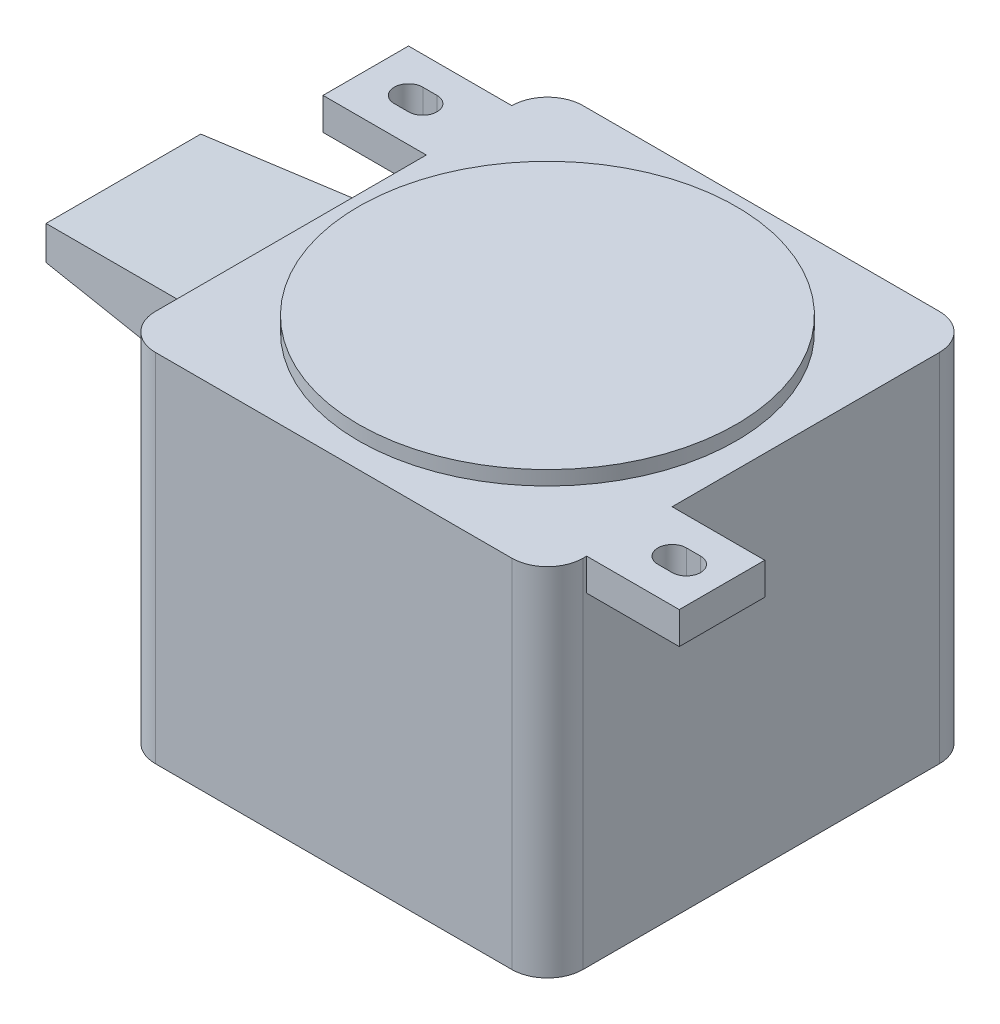
ISO-10303-21;
HEADER;
FILE_DESCRIPTION(('STEP AP214'),'2;1');
FILE_NAME('part.step','',(''),(''),'','','');
FILE_SCHEMA(('AUTOMOTIVE_DESIGN { 1 0 10303 214 1 1 1 1 }'));
ENDSEC;
DATA;
#1=APPLICATION_CONTEXT('core data for automotive mechanical design processes');
#2=APPLICATION_PROTOCOL_DEFINITION('international standard','automotive_design',2000,#1);
#3=PRODUCT_CONTEXT('',#1,'mechanical');
#4=PRODUCT('Part','Part','',(#3));
#5=PRODUCT_RELATED_PRODUCT_CATEGORY('part','',(#4));
#6=PRODUCT_DEFINITION_FORMATION('','',#4);
#7=PRODUCT_DEFINITION_CONTEXT('part definition',#1,'design');
#8=PRODUCT_DEFINITION('design','',#6,#7);
#9=PRODUCT_DEFINITION_SHAPE('','',#8);
#10=(LENGTH_UNIT() NAMED_UNIT(*) SI_UNIT(.MILLI.,.METRE.));
#11=(NAMED_UNIT(*) PLANE_ANGLE_UNIT() SI_UNIT($,.RADIAN.));
#12=(NAMED_UNIT(*) SI_UNIT($,.STERADIAN.) SOLID_ANGLE_UNIT());
#13=UNCERTAINTY_MEASURE_WITH_UNIT(LENGTH_MEASURE(1.E-05),#10,'distance_accuracy_value','');
#14=(GEOMETRIC_REPRESENTATION_CONTEXT(3) GLOBAL_UNCERTAINTY_ASSIGNED_CONTEXT((#13)) GLOBAL_UNIT_ASSIGNED_CONTEXT((#10,
#11,#12)) REPRESENTATION_CONTEXT('',''));
#15=CARTESIAN_POINT('',(0.,0.,0.));
#16=DIRECTION('',(0.,0.,1.));
#17=DIRECTION('',(1.,0.,0.));
#18=AXIS2_PLACEMENT_3D('',#15,#16,#17);
#19=CARTESIAN_POINT('',(-30.,-50.,-30.));
#20=DIRECTION('',(-1.,0.,0.));
#21=DIRECTION('',(0.,0.,1.));
#22=AXIS2_PLACEMENT_3D('',#19,#20,#21);
#23=PLANE('',#22);
#24=DIRECTION('',(0.,0.,1.));
#25=VECTOR('',#24,1.);
#26=CARTESIAN_POINT('',(-30.,-50.,-30.));
#27=LINE('',#26,#25);
#28=CARTESIAN_POINT('',(-30.,-50.,-25.));
#29=VERTEX_POINT('',#28);
#30=CARTESIAN_POINT('',(-30.,-50.,25.));
#31=VERTEX_POINT('',#30);
#32=EDGE_CURVE('E437',#29,#31,#27,.T.);
#33=ORIENTED_EDGE('',*,*,#32,.T.);
#34=DIRECTION('',(0.,1.,0.));
#35=VECTOR('',#34,1.);
#36=CARTESIAN_POINT('',(-30.,-50.,25.));
#37=LINE('',#36,#35);
#38=CARTESIAN_POINT('',(-30.,0.,25.));
#39=VERTEX_POINT('',#38);
#40=EDGE_CURVE('E480',#31,#39,#37,.T.);
#41=ORIENTED_EDGE('',*,*,#40,.T.);
#42=DIRECTION('',(0.,0.,1.));
#43=VECTOR('',#42,1.);
#44=CARTESIAN_POINT('',(-30.,0.,-30.));
#45=LINE('',#44,#43);
#46=CARTESIAN_POINT('',(-30.,0.,-13.));
#47=VERTEX_POINT('',#46);
#48=EDGE_CURVE('E449',#47,#39,#45,.T.);
#49=ORIENTED_EDGE('',*,*,#48,.F.);
#50=DIRECTION('',(0.,1.,0.));
#51=VECTOR('',#50,1.);
#52=CARTESIAN_POINT('',(-30.,-4.5,-13.));
#53=LINE('',#52,#51);
#54=CARTESIAN_POINT('',(-30.,-4.5,-13.));
#55=VERTEX_POINT('',#54);
#56=EDGE_CURVE('E422',#55,#47,#53,.T.);
#57=ORIENTED_EDGE('',*,*,#56,.F.);
#58=DIRECTION('',(0.,0.,-1.));
#59=VECTOR('',#58,1.);
#60=CARTESIAN_POINT('',(-30.,-4.5,-13.));
#61=LINE('',#60,#59);
#62=CARTESIAN_POINT('',(-30.,-4.5,-25.));
#63=VERTEX_POINT('',#62);
#64=EDGE_CURVE('E401',#55,#63,#61,.T.);
#65=ORIENTED_EDGE('',*,*,#64,.T.);
#66=DIRECTION('',(0.,1.,0.));
#67=VECTOR('',#66,1.);
#68=CARTESIAN_POINT('',(-30.,-50.,-25.));
#69=LINE('',#68,#67);
#70=EDGE_CURVE('E478',#63,#29,#69,.F.);
#71=ORIENTED_EDGE('',*,*,#70,.T.);
#72=EDGE_LOOP('',(#33,#41,#49,#57,#65,#71));
#73=FACE_BOUND('',#72,.T.);
#74=DIRECTION('',(0.,0.,1.));
#75=VECTOR('',#74,1.);
#76=CARTESIAN_POINT('',(-30.,-29.85,-18.5));
#77=LINE('',#76,#75);
#78=CARTESIAN_POINT('',(-30.,-29.85,-21.5));
#79=VERTEX_POINT('',#78);
#80=CARTESIAN_POINT('',(-30.,-29.85,-18.5));
#81=VERTEX_POINT('',#80);
#82=EDGE_CURVE('E263',#79,#81,#77,.T.);
#83=ORIENTED_EDGE('',*,*,#82,.F.);
#84=DIRECTION('',(0.,-1.,0.));
#85=VECTOR('',#84,1.);
#86=CARTESIAN_POINT('',(-30.,-29.85,-21.5));
#87=LINE('',#86,#85);
#88=CARTESIAN_POINT('',(-30.,-26.85,-21.5));
#89=VERTEX_POINT('',#88);
#90=EDGE_CURVE('E243',#89,#79,#87,.T.);
#91=ORIENTED_EDGE('',*,*,#90,.F.);
#92=DIRECTION('',(0.,-0.90286051882393,-0.429933580392348));
#93=VECTOR('',#92,1.);
#94=CARTESIAN_POINT('',(-30.,-26.85,-21.5));
#95=LINE('',#94,#93);
#96=CARTESIAN_POINT('',(-30.,-9.,-13.));
#97=VERTEX_POINT('',#96);
#98=EDGE_CURVE('E254',#97,#89,#95,.T.);
#99=ORIENTED_EDGE('',*,*,#98,.F.);
#100=DIRECTION('',(0.,0.,-1.));
#101=VECTOR('',#100,1.);
#102=CARTESIAN_POINT('',(-30.,-9.,-13.));
#103=LINE('',#102,#101);
#104=CARTESIAN_POINT('',(-30.,-9.,13.));
#105=VERTEX_POINT('',#104);
#106=EDGE_CURVE('E274',#105,#97,#103,.T.);
#107=ORIENTED_EDGE('',*,*,#106,.F.);
#108=DIRECTION('',(0.,1.,0.));
#109=VECTOR('',#108,1.);
#110=CARTESIAN_POINT('',(-30.,-9.,13.));
#111=LINE('',#110,#109);
#112=CARTESIAN_POINT('',(-30.,-19.,13.));
#113=VERTEX_POINT('',#112);
#114=EDGE_CURVE('E272',#113,#105,#111,.T.);
#115=ORIENTED_EDGE('',*,*,#114,.F.);
#116=DIRECTION('',(0.,0.,1.));
#117=VECTOR('',#116,1.);
#118=CARTESIAN_POINT('',(-30.,-19.,13.));
#119=LINE('',#118,#117);
#120=CARTESIAN_POINT('',(-30.,-19.,-13.));
#121=VERTEX_POINT('',#120);
#122=EDGE_CURVE('E270',#121,#113,#119,.T.);
#123=ORIENTED_EDGE('',*,*,#122,.F.);
#124=DIRECTION('',(0.,0.891947376713938,0.452139223219047));
#125=VECTOR('',#124,1.);
#126=CARTESIAN_POINT('',(-30.,-19.,-13.));
#127=LINE('',#126,#125);
#128=EDGE_CURVE('E265',#81,#121,#127,.T.);
#129=ORIENTED_EDGE('',*,*,#128,.F.);
#130=EDGE_LOOP('',(#83,#91,#99,#107,#115,#123,#129));
#131=FACE_BOUND('',#130,.T.);
#132=ADVANCED_FACE('F35',(#73,#131),#23,.T.);
#133=CARTESIAN_POINT('',(30.,-50.,-30.));
#134=DIRECTION('',(1.,0.,0.));
#135=DIRECTION('',(0.,0.,-1.));
#136=AXIS2_PLACEMENT_3D('',#133,#134,#135);
#137=PLANE('',#136);
#138=DIRECTION('',(0.,0.,-1.));
#139=VECTOR('',#138,1.);
#140=CARTESIAN_POINT('',(30.,0.,-30.));
#141=LINE('',#140,#139);
#142=CARTESIAN_POINT('',(30.,0.,25.));
#143=VERTEX_POINT('',#142);
#144=CARTESIAN_POINT('',(30.,0.,24.5));
#145=VERTEX_POINT('',#144);
#146=EDGE_CURVE('E444',#143,#145,#141,.T.);
#147=ORIENTED_EDGE('',*,*,#146,.F.);
#148=DIRECTION('',(0.,1.,0.));
#149=VECTOR('',#148,1.);
#150=CARTESIAN_POINT('',(30.,-50.,25.));
#151=LINE('',#150,#149);
#152=CARTESIAN_POINT('',(30.,-50.,25.));
#153=VERTEX_POINT('',#152);
#154=EDGE_CURVE('E469',#143,#153,#151,.F.);
#155=ORIENTED_EDGE('',*,*,#154,.T.);
#156=DIRECTION('',(0.,0.,-1.));
#157=VECTOR('',#156,1.);
#158=CARTESIAN_POINT('',(30.,-50.,-30.));
#159=LINE('',#158,#157);
#160=CARTESIAN_POINT('',(30.,-50.,-25.));
#161=VERTEX_POINT('',#160);
#162=EDGE_CURVE('E431',#153,#161,#159,.T.);
#163=ORIENTED_EDGE('',*,*,#162,.T.);
#164=DIRECTION('',(0.,1.,0.));
#165=VECTOR('',#164,1.);
#166=CARTESIAN_POINT('',(30.,-50.,-25.));
#167=LINE('',#166,#165);
#168=CARTESIAN_POINT('',(30.,0.,-25.));
#169=VERTEX_POINT('',#168);
#170=EDGE_CURVE('E466',#161,#169,#167,.T.);
#171=ORIENTED_EDGE('',*,*,#170,.T.);
#172=CARTESIAN_POINT('',(30.,0.,12.5));
#173=VERTEX_POINT('',#172);
#174=EDGE_CURVE('E424',#173,#169,#141,.T.);
#175=ORIENTED_EDGE('',*,*,#174,.F.);
#176=DIRECTION('',(0.,1.,0.));
#177=VECTOR('',#176,1.);
#178=CARTESIAN_POINT('',(30.,-4.5,12.5));
#179=LINE('',#178,#177);
#180=CARTESIAN_POINT('',(30.,-4.5,12.5));
#181=VERTEX_POINT('',#180);
#182=EDGE_CURVE('E360',#181,#173,#179,.T.);
#183=ORIENTED_EDGE('',*,*,#182,.F.);
#184=DIRECTION('',(0.,0.,1.));
#185=VECTOR('',#184,1.);
#186=CARTESIAN_POINT('',(30.,-4.5,24.5));
#187=LINE('',#186,#185);
#188=CARTESIAN_POINT('',(30.,-4.5,24.5));
#189=VERTEX_POINT('',#188);
#190=EDGE_CURVE('E339',#181,#189,#187,.T.);
#191=ORIENTED_EDGE('',*,*,#190,.T.);
#192=DIRECTION('',(0.,1.,0.));
#193=VECTOR('',#192,1.);
#194=CARTESIAN_POINT('',(30.,-4.5,24.5));
#195=LINE('',#194,#193);
#196=EDGE_CURVE('E352',#189,#145,#195,.T.);
#197=ORIENTED_EDGE('',*,*,#196,.T.);
#198=EDGE_LOOP('',(#147,#155,#163,#171,#175,#183,#191,#197));
#199=FACE_BOUND('',#198,.T.);
#200=ADVANCED_FACE('F496',(#199),#137,.T.);
#201=CARTESIAN_POINT('',(-30.,-50.,30.));
#202=DIRECTION('',(0.,0.,1.));
#203=DIRECTION('',(1.,0.,0.));
#204=AXIS2_PLACEMENT_3D('',#201,#202,#203);
#205=PLANE('',#204);
#206=DIRECTION('',(1.,0.,0.));
#207=VECTOR('',#206,1.);
#208=CARTESIAN_POINT('',(-30.,-50.,30.));
#209=LINE('',#208,#207);
#210=CARTESIAN_POINT('',(-25.,-50.,30.));
#211=VERTEX_POINT('',#210);
#212=CARTESIAN_POINT('',(25.,-50.,30.));
#213=VERTEX_POINT('',#212);
#214=EDGE_CURVE('E440',#211,#213,#209,.T.);
#215=ORIENTED_EDGE('',*,*,#214,.T.);
#216=DIRECTION('',(0.,1.,0.));
#217=VECTOR('',#216,1.);
#218=CARTESIAN_POINT('',(25.,-50.,30.));
#219=LINE('',#218,#217);
#220=CARTESIAN_POINT('',(25.,0.,30.));
#221=VERTEX_POINT('',#220);
#222=EDGE_CURVE('E455',#213,#221,#219,.T.);
#223=ORIENTED_EDGE('',*,*,#222,.T.);
#224=DIRECTION('',(1.,0.,0.));
#225=VECTOR('',#224,1.);
#226=CARTESIAN_POINT('',(-30.,0.,30.));
#227=LINE('',#226,#225);
#228=CARTESIAN_POINT('',(-25.,0.,30.));
#229=VERTEX_POINT('',#228);
#230=EDGE_CURVE('E435',#229,#221,#227,.T.);
#231=ORIENTED_EDGE('',*,*,#230,.F.);
#232=DIRECTION('',(0.,1.,0.));
#233=VECTOR('',#232,1.);
#234=CARTESIAN_POINT('',(-25.,-50.,30.));
#235=LINE('',#234,#233);
#236=EDGE_CURVE('E443',#229,#211,#235,.F.);
#237=ORIENTED_EDGE('',*,*,#236,.T.);
#238=EDGE_LOOP('',(#215,#223,#231,#237));
#239=FACE_BOUND('',#238,.T.);
#240=ADVANCED_FACE('F521',(#239),#205,.T.);
#241=CARTESIAN_POINT('',(-30.,-50.,-30.));
#242=DIRECTION('',(0.,0.,-1.));
#243=DIRECTION('',(-1.,0.,0.));
#244=AXIS2_PLACEMENT_3D('',#241,#242,#243);
#245=PLANE('',#244);
#246=DIRECTION('',(-1.,0.,0.));
#247=VECTOR('',#246,1.);
#248=CARTESIAN_POINT('',(-30.,-50.,-30.));
#249=LINE('',#248,#247);
#250=CARTESIAN_POINT('',(25.,-50.,-30.));
#251=VERTEX_POINT('',#250);
#252=CARTESIAN_POINT('',(-25.,-50.,-30.));
#253=VERTEX_POINT('',#252);
#254=EDGE_CURVE('E434',#251,#253,#249,.T.);
#255=ORIENTED_EDGE('',*,*,#254,.T.);
#256=DIRECTION('',(0.,1.,0.));
#257=VECTOR('',#256,1.);
#258=CARTESIAN_POINT('',(-25.,-50.,-30.));
#259=LINE('',#258,#257);
#260=CARTESIAN_POINT('',(-25.,0.,-30.));
#261=VERTEX_POINT('',#260);
#262=EDGE_CURVE('E11',#253,#261,#259,.T.);
#263=ORIENTED_EDGE('',*,*,#262,.T.);
#264=DIRECTION('',(-1.,0.,0.));
#265=VECTOR('',#264,1.);
#266=CARTESIAN_POINT('',(-30.,0.,-30.));
#267=LINE('',#266,#265);
#268=CARTESIAN_POINT('',(25.,0.,-30.));
#269=VERTEX_POINT('',#268);
#270=EDGE_CURVE('E446',#269,#261,#267,.T.);
#271=ORIENTED_EDGE('',*,*,#270,.F.);
#272=DIRECTION('',(0.,1.,0.));
#273=VECTOR('',#272,1.);
#274=CARTESIAN_POINT('',(25.,-50.,-30.));
#275=LINE('',#274,#273);
#276=EDGE_CURVE('E43',#269,#251,#275,.F.);
#277=ORIENTED_EDGE('',*,*,#276,.T.);
#278=EDGE_LOOP('',(#255,#263,#271,#277));
#279=FACE_BOUND('',#278,.T.);
#280=ADVANCED_FACE('F485',(#279),#245,.T.);
#281=CARTESIAN_POINT('',(0.,-50.,0.));
#282=DIRECTION('',(0.,1.,0.));
#283=DIRECTION('',(0.,0.,1.));
#284=AXIS2_PLACEMENT_3D('',#281,#282,#283);
#285=PLANE('',#284);
#286=ORIENTED_EDGE('',*,*,#162,.F.);
#287=CARTESIAN_POINT('',(25.,-50.,25.));
#288=DIRECTION('',(0.,1.,0.));
#289=DIRECTION('',(0.,0.,1.));
#290=AXIS2_PLACEMENT_3D('',#287,#288,#289);
#291=CIRCLE('',#290,5.);
#292=EDGE_CURVE('E476',#153,#213,#291,.F.);
#293=ORIENTED_EDGE('',*,*,#292,.T.);
#294=ORIENTED_EDGE('',*,*,#214,.F.);
#295=CARTESIAN_POINT('',(-25.,-50.,25.));
#296=DIRECTION('',(0.,1.,0.));
#297=DIRECTION('',(0.,0.,1.));
#298=AXIS2_PLACEMENT_3D('',#295,#296,#297);
#299=CIRCLE('',#298,5.);
#300=EDGE_CURVE('E474',#211,#31,#299,.F.);
#301=ORIENTED_EDGE('',*,*,#300,.T.);
#302=ORIENTED_EDGE('',*,*,#32,.F.);
#303=CARTESIAN_POINT('',(-25.,-50.,-25.));
#304=DIRECTION('',(0.,1.,0.));
#305=DIRECTION('',(0.,0.,1.));
#306=AXIS2_PLACEMENT_3D('',#303,#304,#305);
#307=CIRCLE('',#306,5.);
#308=EDGE_CURVE('E58',#29,#253,#307,.F.);
#309=ORIENTED_EDGE('',*,*,#308,.T.);
#310=ORIENTED_EDGE('',*,*,#254,.F.);
#311=CARTESIAN_POINT('',(25.,-50.,-25.));
#312=DIRECTION('',(0.,1.,0.));
#313=DIRECTION('',(0.,0.,1.));
#314=AXIS2_PLACEMENT_3D('',#311,#312,#313);
#315=CIRCLE('',#314,5.);
#316=EDGE_CURVE('E471',#251,#161,#315,.F.);
#317=ORIENTED_EDGE('',*,*,#316,.T.);
#318=EDGE_LOOP('',(#286,#293,#294,#301,#302,#309,#310,#317));
#319=FACE_BOUND('',#318,.T.);
#320=ADVANCED_FACE('F490',(#319),#285,.F.);
#321=CARTESIAN_POINT('',(0.,0.,0.));
#322=DIRECTION('',(0.,1.,0.));
#323=DIRECTION('',(0.,0.,1.));
#324=AXIS2_PLACEMENT_3D('',#321,#322,#323);
#325=PLANE('',#324);
#326=CARTESIAN_POINT('',(0.,0.,0.));
#327=DIRECTION('',(0.,1.,0.));
#328=DIRECTION('',(0.,0.,1.));
#329=AXIS2_PLACEMENT_3D('',#326,#327,#328);
#330=CIRCLE('',#329,26.5);
#331=CARTESIAN_POINT('',(0.,0.,26.5));
#332=VERTEX_POINT('',#331);
#333=EDGE_CURVE('E300',#332,#332,#330,.T.);
#334=ORIENTED_EDGE('',*,*,#333,.F.);
#335=EDGE_LOOP('',(#334));
#336=FACE_BOUND('',#335,.T.);
#337=ORIENTED_EDGE('',*,*,#230,.T.);
#338=CARTESIAN_POINT('',(25.,0.,25.));
#339=DIRECTION('',(0.,1.,0.));
#340=DIRECTION('',(0.,0.,1.));
#341=AXIS2_PLACEMENT_3D('',#338,#339,#340);
#342=CIRCLE('',#341,5.);
#343=EDGE_CURVE('E464',#221,#143,#342,.T.);
#344=ORIENTED_EDGE('',*,*,#343,.T.);
#345=ORIENTED_EDGE('',*,*,#146,.T.);
#346=DIRECTION('',(1.,0.,0.));
#347=VECTOR('',#346,1.);
#348=CARTESIAN_POINT('',(43.,0.,24.5));
#349=LINE('',#348,#347);
#350=CARTESIAN_POINT('',(43.,0.,24.5));
#351=VERTEX_POINT('',#350);
#352=EDGE_CURVE('E332',#145,#351,#349,.T.);
#353=ORIENTED_EDGE('',*,*,#352,.T.);
#354=DIRECTION('',(0.,0.,-1.));
#355=VECTOR('',#354,1.);
#356=CARTESIAN_POINT('',(43.,0.,12.5));
#357=LINE('',#356,#355);
#358=CARTESIAN_POINT('',(43.,0.,12.5));
#359=VERTEX_POINT('',#358);
#360=EDGE_CURVE('E355',#351,#359,#357,.T.);
#361=ORIENTED_EDGE('',*,*,#360,.T.);
#362=DIRECTION('',(-1.,0.,0.));
#363=VECTOR('',#362,1.);
#364=CARTESIAN_POINT('',(30.,0.,12.5));
#365=LINE('',#364,#363);
#366=EDGE_CURVE('E343',#359,#173,#365,.T.);
#367=ORIENTED_EDGE('',*,*,#366,.T.);
#368=ORIENTED_EDGE('',*,*,#174,.T.);
#369=CARTESIAN_POINT('',(25.,0.,-25.));
#370=DIRECTION('',(0.,1.,0.));
#371=DIRECTION('',(0.,0.,1.));
#372=AXIS2_PLACEMENT_3D('',#369,#370,#371);
#373=CIRCLE('',#372,5.);
#374=EDGE_CURVE('E458',#169,#269,#373,.T.);
#375=ORIENTED_EDGE('',*,*,#374,.T.);
#376=ORIENTED_EDGE('',*,*,#270,.T.);
#377=CARTESIAN_POINT('',(-25.,0.,-25.));
#378=DIRECTION('',(0.,1.,0.));
#379=DIRECTION('',(0.,0.,1.));
#380=AXIS2_PLACEMENT_3D('',#377,#378,#379);
#381=CIRCLE('',#380,5.);
#382=CARTESIAN_POINT('',(-30.,0.,-25.));
#383=VERTEX_POINT('',#382);
#384=EDGE_CURVE('E460',#261,#383,#381,.T.);
#385=ORIENTED_EDGE('',*,*,#384,.T.);
#386=DIRECTION('',(-1.,0.,0.));
#387=VECTOR('',#386,1.);
#388=CARTESIAN_POINT('',(-30.,0.,-25.));
#389=LINE('',#388,#387);
#390=CARTESIAN_POINT('',(-44.5,0.,-25.));
#391=VERTEX_POINT('',#390);
#392=EDGE_CURVE('E394',#383,#391,#389,.T.);
#393=ORIENTED_EDGE('',*,*,#392,.T.);
#394=DIRECTION('',(0.,0.,1.));
#395=VECTOR('',#394,1.);
#396=CARTESIAN_POINT('',(-44.5,0.,-25.));
#397=LINE('',#396,#395);
#398=CARTESIAN_POINT('',(-44.5,0.,-13.));
#399=VERTEX_POINT('',#398);
#400=EDGE_CURVE('E417',#391,#399,#397,.T.);
#401=ORIENTED_EDGE('',*,*,#400,.T.);
#402=DIRECTION('',(1.,0.,0.));
#403=VECTOR('',#402,1.);
#404=CARTESIAN_POINT('',(-44.5,0.,-13.));
#405=LINE('',#404,#403);
#406=EDGE_CURVE('E405',#399,#47,#405,.T.);
#407=ORIENTED_EDGE('',*,*,#406,.T.);
#408=ORIENTED_EDGE('',*,*,#48,.T.);
#409=CARTESIAN_POINT('',(-25.,0.,25.));
#410=DIRECTION('',(0.,1.,0.));
#411=DIRECTION('',(0.,0.,1.));
#412=AXIS2_PLACEMENT_3D('',#409,#410,#411);
#413=CIRCLE('',#412,5.);
#414=EDGE_CURVE('E462',#39,#229,#413,.T.);
#415=ORIENTED_EDGE('',*,*,#414,.T.);
#416=EDGE_LOOP('',(#337,#344,#345,#353,#361,#367,#368,#375,#376,#385,#393,#401,#407,#408,#415));
#417=FACE_BOUND('',#416,.T.);
#418=CARTESIAN_POINT('',(-38.5,0.,-19.));
#419=DIRECTION('',(0.,1.,0.));
#420=DIRECTION('',(0.,0.,1.));
#421=AXIS2_PLACEMENT_3D('',#418,#419,#420);
#422=CIRCLE('',#421,2.);
#423=CARTESIAN_POINT('',(-38.5,0.,-21.));
#424=VERTEX_POINT('',#423);
#425=CARTESIAN_POINT('',(-38.5,0.,-17.));
#426=VERTEX_POINT('',#425);
#427=EDGE_CURVE('E362',#424,#426,#422,.T.);
#428=ORIENTED_EDGE('',*,*,#427,.F.);
#429=DIRECTION('',(-1.,0.,0.));
#430=VECTOR('',#429,1.);
#431=CARTESIAN_POINT('',(-38.5,0.,-21.));
#432=LINE('',#431,#430);
#433=CARTESIAN_POINT('',(-36.5,0.,-21.));
#434=VERTEX_POINT('',#433);
#435=EDGE_CURVE('E373',#434,#424,#432,.T.);
#436=ORIENTED_EDGE('',*,*,#435,.F.);
#437=CARTESIAN_POINT('',(-36.5,0.,-19.));
#438=DIRECTION('',(0.,1.,0.));
#439=DIRECTION('',(0.,0.,1.));
#440=AXIS2_PLACEMENT_3D('',#437,#438,#439);
#441=CIRCLE('',#440,2.);
#442=CARTESIAN_POINT('',(-36.5,0.,-17.));
#443=VERTEX_POINT('',#442);
#444=EDGE_CURVE('E387',#443,#434,#441,.T.);
#445=ORIENTED_EDGE('',*,*,#444,.F.);
#446=DIRECTION('',(1.,0.,0.));
#447=VECTOR('',#446,1.);
#448=CARTESIAN_POINT('',(-38.5,0.,-17.));
#449=LINE('',#448,#447);
#450=EDGE_CURVE('E384',#426,#443,#449,.T.);
#451=ORIENTED_EDGE('',*,*,#450,.F.);
#452=EDGE_LOOP('',(#428,#436,#445,#451));
#453=FACE_BOUND('',#452,.T.);
#454=DIRECTION('',(1.,0.,0.));
#455=VECTOR('',#454,1.);
#456=CARTESIAN_POINT('',(36.,0.,20.5));
#457=LINE('',#456,#455);
#458=CARTESIAN_POINT('',(36.,0.,20.5));
#459=VERTEX_POINT('',#458);
#460=CARTESIAN_POINT('',(38.,0.,20.5));
#461=VERTEX_POINT('',#460);
#462=EDGE_CURVE('E322',#459,#461,#457,.T.);
#463=ORIENTED_EDGE('',*,*,#462,.F.);
#464=CARTESIAN_POINT('',(36.,0.,18.5));
#465=DIRECTION('',(0.,1.,0.));
#466=DIRECTION('',(0.,0.,1.));
#467=AXIS2_PLACEMENT_3D('',#464,#465,#466);
#468=CIRCLE('',#467,2.);
#469=CARTESIAN_POINT('',(36.,0.,16.5));
#470=VERTEX_POINT('',#469);
#471=EDGE_CURVE('E304',#470,#459,#468,.T.);
#472=ORIENTED_EDGE('',*,*,#471,.F.);
#473=DIRECTION('',(-1.,0.,0.));
#474=VECTOR('',#473,1.);
#475=CARTESIAN_POINT('',(36.,0.,16.5));
#476=LINE('',#475,#474);
#477=CARTESIAN_POINT('',(38.,0.,16.5));
#478=VERTEX_POINT('',#477);
#479=EDGE_CURVE('E311',#478,#470,#476,.T.);
#480=ORIENTED_EDGE('',*,*,#479,.F.);
#481=CARTESIAN_POINT('',(38.,0.,18.5));
#482=DIRECTION('',(0.,1.,0.));
#483=DIRECTION('',(0.,0.,1.));
#484=AXIS2_PLACEMENT_3D('',#481,#482,#483);
#485=CIRCLE('',#484,2.);
#486=EDGE_CURVE('E325',#461,#478,#485,.T.);
#487=ORIENTED_EDGE('',*,*,#486,.F.);
#488=EDGE_LOOP('',(#463,#472,#480,#487));
#489=FACE_BOUND('',#488,.T.);
#490=ADVANCED_FACE('F499',(#336,#417,#453,#489),#325,.T.);
#491=CARTESIAN_POINT('',(-44.5,-4.5,-13.));
#492=DIRECTION('',(0.,0.,1.));
#493=DIRECTION('',(1.,0.,0.));
#494=AXIS2_PLACEMENT_3D('',#491,#492,#493);
#495=PLANE('',#494);
#496=ORIENTED_EDGE('',*,*,#406,.F.);
#497=DIRECTION('',(0.,1.,0.));
#498=VECTOR('',#497,1.);
#499=CARTESIAN_POINT('',(-44.5,-4.5,-13.));
#500=LINE('',#499,#498);
#501=CARTESIAN_POINT('',(-44.5,-4.5,-13.));
#502=VERTEX_POINT('',#501);
#503=EDGE_CURVE('E425',#502,#399,#500,.T.);
#504=ORIENTED_EDGE('',*,*,#503,.F.);
#505=DIRECTION('',(1.,0.,0.));
#506=VECTOR('',#505,1.);
#507=CARTESIAN_POINT('',(-44.5,-4.5,-13.));
#508=LINE('',#507,#506);
#509=EDGE_CURVE('E411',#502,#55,#508,.T.);
#510=ORIENTED_EDGE('',*,*,#509,.T.);
#511=ORIENTED_EDGE('',*,*,#56,.T.);
#512=EDGE_LOOP('',(#496,#504,#510,#511));
#513=FACE_BOUND('',#512,.T.);
#514=ADVANCED_FACE('F543',(#513),#495,.T.);
#515=CARTESIAN_POINT('',(-44.5,-4.5,-25.));
#516=DIRECTION('',(-1.,0.,0.));
#517=DIRECTION('',(0.,0.,1.));
#518=AXIS2_PLACEMENT_3D('',#515,#516,#517);
#519=PLANE('',#518);
#520=ORIENTED_EDGE('',*,*,#400,.F.);
#521=DIRECTION('',(0.,1.,0.));
#522=VECTOR('',#521,1.);
#523=CARTESIAN_POINT('',(-44.5,-4.5,-25.));
#524=LINE('',#523,#522);
#525=CARTESIAN_POINT('',(-44.5,-4.5,-25.));
#526=VERTEX_POINT('',#525);
#527=EDGE_CURVE('E427',#526,#391,#524,.T.);
#528=ORIENTED_EDGE('',*,*,#527,.F.);
#529=DIRECTION('',(0.,0.,1.));
#530=VECTOR('',#529,1.);
#531=CARTESIAN_POINT('',(-44.5,-4.5,-25.));
#532=LINE('',#531,#530);
#533=EDGE_CURVE('E408',#526,#502,#532,.T.);
#534=ORIENTED_EDGE('',*,*,#533,.T.);
#535=ORIENTED_EDGE('',*,*,#503,.T.);
#536=EDGE_LOOP('',(#520,#528,#534,#535));
#537=FACE_BOUND('',#536,.T.);
#538=ADVANCED_FACE('F540',(#537),#519,.T.);
#539=CARTESIAN_POINT('',(-30.,-4.5,-25.));
#540=DIRECTION('',(0.,0.,-1.));
#541=DIRECTION('',(-1.,0.,0.));
#542=AXIS2_PLACEMENT_3D('',#539,#540,#541);
#543=PLANE('',#542);
#544=ORIENTED_EDGE('',*,*,#392,.F.);
#545=DIRECTION('',(0.,1.,0.));
#546=VECTOR('',#545,1.);
#547=CARTESIAN_POINT('',(-30.,-4.5,-25.));
#548=LINE('',#547,#546);
#549=EDGE_CURVE('E414',#63,#383,#548,.T.);
#550=ORIENTED_EDGE('',*,*,#549,.F.);
#551=DIRECTION('',(-1.,0.,0.));
#552=VECTOR('',#551,1.);
#553=CARTESIAN_POINT('',(-30.,-4.5,-25.));
#554=LINE('',#553,#552);
#555=EDGE_CURVE('E404',#63,#526,#554,.T.);
#556=ORIENTED_EDGE('',*,*,#555,.T.);
#557=ORIENTED_EDGE('',*,*,#527,.T.);
#558=EDGE_LOOP('',(#544,#550,#556,#557));
#559=FACE_BOUND('',#558,.T.);
#560=ADVANCED_FACE('F535',(#559),#543,.T.);
#561=CARTESIAN_POINT('',(0.,-4.5,0.));
#562=DIRECTION('',(0.,1.,0.));
#563=DIRECTION('',(0.,0.,1.));
#564=AXIS2_PLACEMENT_3D('',#561,#562,#563);
#565=PLANE('',#564);
#566=DIRECTION('',(-1.,0.,0.));
#567=VECTOR('',#566,1.);
#568=CARTESIAN_POINT('',(-38.5,-4.5,-21.));
#569=LINE('',#568,#567);
#570=CARTESIAN_POINT('',(-36.5,-4.5,-21.));
#571=VERTEX_POINT('',#570);
#572=CARTESIAN_POINT('',(-38.5,-4.5,-21.));
#573=VERTEX_POINT('',#572);
#574=EDGE_CURVE('E379',#571,#573,#569,.T.);
#575=ORIENTED_EDGE('',*,*,#574,.T.);
#576=CARTESIAN_POINT('',(-38.5,-4.5,-19.));
#577=DIRECTION('',(0.,1.,0.));
#578=DIRECTION('',(0.,0.,1.));
#579=AXIS2_PLACEMENT_3D('',#576,#577,#578);
#580=CIRCLE('',#579,2.);
#581=CARTESIAN_POINT('',(-38.5,-4.5,-17.));
#582=VERTEX_POINT('',#581);
#583=EDGE_CURVE('E369',#573,#582,#580,.T.);
#584=ORIENTED_EDGE('',*,*,#583,.T.);
#585=DIRECTION('',(1.,0.,0.));
#586=VECTOR('',#585,1.);
#587=CARTESIAN_POINT('',(-38.5,-4.5,-17.));
#588=LINE('',#587,#586);
#589=CARTESIAN_POINT('',(-36.5,-4.5,-17.));
#590=VERTEX_POINT('',#589);
#591=EDGE_CURVE('E372',#582,#590,#588,.T.);
#592=ORIENTED_EDGE('',*,*,#591,.T.);
#593=CARTESIAN_POINT('',(-36.5,-4.5,-19.));
#594=DIRECTION('',(0.,1.,0.));
#595=DIRECTION('',(0.,0.,1.));
#596=AXIS2_PLACEMENT_3D('',#593,#594,#595);
#597=CIRCLE('',#596,2.);
#598=EDGE_CURVE('E376',#590,#571,#597,.T.);
#599=ORIENTED_EDGE('',*,*,#598,.T.);
#600=EDGE_LOOP('',(#575,#584,#592,#599));
#601=FACE_BOUND('',#600,.T.);
#602=ORIENTED_EDGE('',*,*,#64,.F.);
#603=ORIENTED_EDGE('',*,*,#509,.F.);
#604=ORIENTED_EDGE('',*,*,#533,.F.);
#605=ORIENTED_EDGE('',*,*,#555,.F.);
#606=EDGE_LOOP('',(#602,#603,#604,#605));
#607=FACE_BOUND('',#606,.T.);
#608=ADVANCED_FACE('F546',(#601,#607),#565,.F.);
#609=CARTESIAN_POINT('',(-38.5,-4.5,-19.));
#610=DIRECTION('',(0.,1.,0.));
#611=DIRECTION('',(0.,0.,1.));
#612=AXIS2_PLACEMENT_3D('',#609,#610,#611);
#613=CYLINDRICAL_SURFACE('',#612,2.);
#614=ORIENTED_EDGE('',*,*,#427,.T.);
#615=DIRECTION('',(0.,1.,0.));
#616=VECTOR('',#615,1.);
#617=CARTESIAN_POINT('',(-38.5,-4.5,-17.));
#618=LINE('',#617,#616);
#619=EDGE_CURVE('E382',#582,#426,#618,.T.);
#620=ORIENTED_EDGE('',*,*,#619,.F.);
#621=ORIENTED_EDGE('',*,*,#583,.F.);
#622=DIRECTION('',(0.,1.,0.));
#623=VECTOR('',#622,1.);
#624=CARTESIAN_POINT('',(-38.5,-4.5,-21.));
#625=LINE('',#624,#623);
#626=EDGE_CURVE('E392',#573,#424,#625,.T.);
#627=ORIENTED_EDGE('',*,*,#626,.T.);
#628=EDGE_LOOP('',(#614,#620,#621,#627));
#629=FACE_BOUND('',#628,.T.);
#630=ADVANCED_FACE('F548',(#629),#613,.F.);
#631=CARTESIAN_POINT('',(-38.5,-4.5,-21.));
#632=DIRECTION('',(0.,0.,-1.));
#633=DIRECTION('',(-1.,0.,0.));
#634=AXIS2_PLACEMENT_3D('',#631,#632,#633);
#635=PLANE('',#634);
#636=ORIENTED_EDGE('',*,*,#435,.T.);
#637=ORIENTED_EDGE('',*,*,#626,.F.);
#638=ORIENTED_EDGE('',*,*,#574,.F.);
#639=DIRECTION('',(0.,1.,0.));
#640=VECTOR('',#639,1.);
#641=CARTESIAN_POINT('',(-36.5,-4.5,-21.));
#642=LINE('',#641,#640);
#643=EDGE_CURVE('E395',#571,#434,#642,.T.);
#644=ORIENTED_EDGE('',*,*,#643,.T.);
#645=EDGE_LOOP('',(#636,#637,#638,#644));
#646=FACE_BOUND('',#645,.T.);
#647=ADVANCED_FACE('F555',(#646),#635,.F.);
#648=CARTESIAN_POINT('',(-36.5,-4.5,-19.));
#649=DIRECTION('',(0.,1.,0.));
#650=DIRECTION('',(0.,0.,1.));
#651=AXIS2_PLACEMENT_3D('',#648,#649,#650);
#652=CYLINDRICAL_SURFACE('',#651,2.);
#653=ORIENTED_EDGE('',*,*,#444,.T.);
#654=ORIENTED_EDGE('',*,*,#643,.F.);
#655=ORIENTED_EDGE('',*,*,#598,.F.);
#656=DIRECTION('',(0.,1.,0.));
#657=VECTOR('',#656,1.);
#658=CARTESIAN_POINT('',(-36.5,-4.5,-17.));
#659=LINE('',#658,#657);
#660=EDGE_CURVE('E397',#590,#443,#659,.T.);
#661=ORIENTED_EDGE('',*,*,#660,.T.);
#662=EDGE_LOOP('',(#653,#654,#655,#661));
#663=FACE_BOUND('',#662,.T.);
#664=ADVANCED_FACE('F636',(#663),#652,.F.);
#665=CARTESIAN_POINT('',(-38.5,-4.5,-17.));
#666=DIRECTION('',(0.,0.,1.));
#667=DIRECTION('',(1.,0.,0.));
#668=AXIS2_PLACEMENT_3D('',#665,#666,#667);
#669=PLANE('',#668);
#670=ORIENTED_EDGE('',*,*,#450,.T.);
#671=ORIENTED_EDGE('',*,*,#660,.F.);
#672=ORIENTED_EDGE('',*,*,#591,.F.);
#673=ORIENTED_EDGE('',*,*,#619,.T.);
#674=EDGE_LOOP('',(#670,#671,#672,#673));
#675=FACE_BOUND('',#674,.T.);
#676=ADVANCED_FACE('F628',(#675),#669,.F.);
#677=CARTESIAN_POINT('',(30.,-4.5,12.5));
#678=DIRECTION('',(0.,0.,-1.));
#679=DIRECTION('',(-1.,0.,0.));
#680=AXIS2_PLACEMENT_3D('',#677,#678,#679);
#681=PLANE('',#680);
#682=ORIENTED_EDGE('',*,*,#366,.F.);
#683=DIRECTION('',(0.,1.,0.));
#684=VECTOR('',#683,1.);
#685=CARTESIAN_POINT('',(43.,-4.5,12.5));
#686=LINE('',#685,#684);
#687=CARTESIAN_POINT('',(43.,-4.5,12.5));
#688=VERTEX_POINT('',#687);
#689=EDGE_CURVE('E363',#688,#359,#686,.T.);
#690=ORIENTED_EDGE('',*,*,#689,.F.);
#691=DIRECTION('',(-1.,0.,0.));
#692=VECTOR('',#691,1.);
#693=CARTESIAN_POINT('',(30.,-4.5,12.5));
#694=LINE('',#693,#692);
#695=EDGE_CURVE('E349',#688,#181,#694,.T.);
#696=ORIENTED_EDGE('',*,*,#695,.T.);
#697=ORIENTED_EDGE('',*,*,#182,.T.);
#698=EDGE_LOOP('',(#682,#690,#696,#697));
#699=FACE_BOUND('',#698,.T.);
#700=ADVANCED_FACE('F504',(#699),#681,.T.);
#701=CARTESIAN_POINT('',(43.,-4.5,12.5));
#702=DIRECTION('',(1.,0.,0.));
#703=DIRECTION('',(0.,0.,-1.));
#704=AXIS2_PLACEMENT_3D('',#701,#702,#703);
#705=PLANE('',#704);
#706=ORIENTED_EDGE('',*,*,#360,.F.);
#707=DIRECTION('',(0.,1.,0.));
#708=VECTOR('',#707,1.);
#709=CARTESIAN_POINT('',(43.,-4.5,24.5));
#710=LINE('',#709,#708);
#711=CARTESIAN_POINT('',(43.,-4.5,24.5));
#712=VERTEX_POINT('',#711);
#713=EDGE_CURVE('E365',#712,#351,#710,.T.);
#714=ORIENTED_EDGE('',*,*,#713,.F.);
#715=DIRECTION('',(0.,0.,-1.));
#716=VECTOR('',#715,1.);
#717=CARTESIAN_POINT('',(43.,-4.5,12.5));
#718=LINE('',#717,#716);
#719=EDGE_CURVE('E346',#712,#688,#718,.T.);
#720=ORIENTED_EDGE('',*,*,#719,.T.);
#721=ORIENTED_EDGE('',*,*,#689,.T.);
#722=EDGE_LOOP('',(#706,#714,#720,#721));
#723=FACE_BOUND('',#722,.T.);
#724=ADVANCED_FACE('F627',(#723),#705,.T.);
#725=CARTESIAN_POINT('',(43.,-4.5,24.5));
#726=DIRECTION('',(0.,0.,1.));
#727=DIRECTION('',(1.,0.,0.));
#728=AXIS2_PLACEMENT_3D('',#725,#726,#727);
#729=PLANE('',#728);
#730=ORIENTED_EDGE('',*,*,#352,.F.);
#731=ORIENTED_EDGE('',*,*,#196,.F.);
#732=DIRECTION('',(1.,0.,0.));
#733=VECTOR('',#732,1.);
#734=CARTESIAN_POINT('',(43.,-4.5,24.5));
#735=LINE('',#734,#733);
#736=EDGE_CURVE('E342',#189,#712,#735,.T.);
#737=ORIENTED_EDGE('',*,*,#736,.T.);
#738=ORIENTED_EDGE('',*,*,#713,.T.);
#739=EDGE_LOOP('',(#730,#731,#737,#738));
#740=FACE_BOUND('',#739,.T.);
#741=ADVANCED_FACE('F512',(#740),#729,.T.);
#742=CARTESIAN_POINT('',(0.,-4.5,0.));
#743=DIRECTION('',(0.,-1.,0.));
#744=DIRECTION('',(0.,0.,-1.));
#745=AXIS2_PLACEMENT_3D('',#742,#743,#744);
#746=PLANE('',#745);
#747=CARTESIAN_POINT('',(36.,-4.5,18.5));
#748=DIRECTION('',(0.,1.,0.));
#749=DIRECTION('',(0.,0.,1.));
#750=AXIS2_PLACEMENT_3D('',#747,#748,#749);
#751=CIRCLE('',#750,2.);
#752=CARTESIAN_POINT('',(36.,-4.5,16.5));
#753=VERTEX_POINT('',#752);
#754=CARTESIAN_POINT('',(36.,-4.5,20.5));
#755=VERTEX_POINT('',#754);
#756=EDGE_CURVE('E307',#753,#755,#751,.T.);
#757=ORIENTED_EDGE('',*,*,#756,.T.);
#758=DIRECTION('',(1.,0.,0.));
#759=VECTOR('',#758,1.);
#760=CARTESIAN_POINT('',(36.,-4.5,20.5));
#761=LINE('',#760,#759);
#762=CARTESIAN_POINT('',(38.,-4.5,20.5));
#763=VERTEX_POINT('',#762);
#764=EDGE_CURVE('E310',#755,#763,#761,.T.);
#765=ORIENTED_EDGE('',*,*,#764,.T.);
#766=CARTESIAN_POINT('',(38.,-4.5,18.5));
#767=DIRECTION('',(0.,1.,0.));
#768=DIRECTION('',(0.,0.,1.));
#769=AXIS2_PLACEMENT_3D('',#766,#767,#768);
#770=CIRCLE('',#769,2.);
#771=CARTESIAN_POINT('',(38.,-4.5,16.5));
#772=VERTEX_POINT('',#771);
#773=EDGE_CURVE('E314',#763,#772,#770,.T.);
#774=ORIENTED_EDGE('',*,*,#773,.T.);
#775=DIRECTION('',(-1.,0.,0.));
#776=VECTOR('',#775,1.);
#777=CARTESIAN_POINT('',(36.,-4.5,16.5));
#778=LINE('',#777,#776);
#779=EDGE_CURVE('E317',#772,#753,#778,.T.);
#780=ORIENTED_EDGE('',*,*,#779,.T.);
#781=EDGE_LOOP('',(#757,#765,#774,#780));
#782=FACE_BOUND('',#781,.T.);
#783=ORIENTED_EDGE('',*,*,#190,.F.);
#784=ORIENTED_EDGE('',*,*,#695,.F.);
#785=ORIENTED_EDGE('',*,*,#719,.F.);
#786=ORIENTED_EDGE('',*,*,#736,.F.);
#787=EDGE_LOOP('',(#783,#784,#785,#786));
#788=FACE_BOUND('',#787,.T.);
#789=ADVANCED_FACE('F508',(#782,#788),#746,.T.);
#790=CARTESIAN_POINT('',(36.,-4.5,18.5));
#791=DIRECTION('',(0.,1.,0.));
#792=DIRECTION('',(0.,0.,1.));
#793=AXIS2_PLACEMENT_3D('',#790,#791,#792);
#794=CYLINDRICAL_SURFACE('',#793,2.);
#795=ORIENTED_EDGE('',*,*,#471,.T.);
#796=DIRECTION('',(0.,1.,0.));
#797=VECTOR('',#796,1.);
#798=CARTESIAN_POINT('',(36.,-4.5,20.5));
#799=LINE('',#798,#797);
#800=EDGE_CURVE('E320',#755,#459,#799,.T.);
#801=ORIENTED_EDGE('',*,*,#800,.F.);
#802=ORIENTED_EDGE('',*,*,#756,.F.);
#803=DIRECTION('',(0.,1.,0.));
#804=VECTOR('',#803,1.);
#805=CARTESIAN_POINT('',(36.,-4.5,16.5));
#806=LINE('',#805,#804);
#807=EDGE_CURVE('E330',#753,#470,#806,.T.);
#808=ORIENTED_EDGE('',*,*,#807,.T.);
#809=EDGE_LOOP('',(#795,#801,#802,#808));
#810=FACE_BOUND('',#809,.T.);
#811=ADVANCED_FACE('F611',(#810),#794,.F.);
#812=CARTESIAN_POINT('',(36.,-4.5,16.5));
#813=DIRECTION('',(0.,0.,-1.));
#814=DIRECTION('',(-1.,0.,0.));
#815=AXIS2_PLACEMENT_3D('',#812,#813,#814);
#816=PLANE('',#815);
#817=ORIENTED_EDGE('',*,*,#479,.T.);
#818=ORIENTED_EDGE('',*,*,#807,.F.);
#819=ORIENTED_EDGE('',*,*,#779,.F.);
#820=DIRECTION('',(0.,1.,0.));
#821=VECTOR('',#820,1.);
#822=CARTESIAN_POINT('',(38.,-4.5,16.5));
#823=LINE('',#822,#821);
#824=EDGE_CURVE('E333',#772,#478,#823,.T.);
#825=ORIENTED_EDGE('',*,*,#824,.T.);
#826=EDGE_LOOP('',(#817,#818,#819,#825));
#827=FACE_BOUND('',#826,.T.);
#828=ADVANCED_FACE('F607',(#827),#816,.F.);
#829=CARTESIAN_POINT('',(38.,-4.5,18.5));
#830=DIRECTION('',(0.,1.,0.));
#831=DIRECTION('',(0.,0.,1.));
#832=AXIS2_PLACEMENT_3D('',#829,#830,#831);
#833=CYLINDRICAL_SURFACE('',#832,2.);
#834=ORIENTED_EDGE('',*,*,#486,.T.);
#835=ORIENTED_EDGE('',*,*,#824,.F.);
#836=ORIENTED_EDGE('',*,*,#773,.F.);
#837=DIRECTION('',(0.,1.,0.));
#838=VECTOR('',#837,1.);
#839=CARTESIAN_POINT('',(38.,-4.5,20.5));
#840=LINE('',#839,#838);
#841=EDGE_CURVE('E335',#763,#461,#840,.T.);
#842=ORIENTED_EDGE('',*,*,#841,.T.);
#843=EDGE_LOOP('',(#834,#835,#836,#842));
#844=FACE_BOUND('',#843,.T.);
#845=ADVANCED_FACE('F610',(#844),#833,.F.);
#846=CARTESIAN_POINT('',(36.,-4.5,20.5));
#847=DIRECTION('',(0.,0.,1.));
#848=DIRECTION('',(1.,0.,0.));
#849=AXIS2_PLACEMENT_3D('',#846,#847,#848);
#850=PLANE('',#849);
#851=ORIENTED_EDGE('',*,*,#462,.T.);
#852=ORIENTED_EDGE('',*,*,#841,.F.);
#853=ORIENTED_EDGE('',*,*,#764,.F.);
#854=ORIENTED_EDGE('',*,*,#800,.T.);
#855=EDGE_LOOP('',(#851,#852,#853,#854));
#856=FACE_BOUND('',#855,.T.);
#857=ADVANCED_FACE('F605',(#856),#850,.F.);
#858=CARTESIAN_POINT('',(0.,2.,0.));
#859=DIRECTION('',(0.,-1.,0.));
#860=DIRECTION('',(0.,0.,-1.));
#861=AXIS2_PLACEMENT_3D('',#858,#859,#860);
#862=CYLINDRICAL_SURFACE('',#861,26.5);
#863=CARTESIAN_POINT('',(0.,2.,0.));
#864=DIRECTION('',(0.,1.,0.));
#865=DIRECTION('',(0.,0.,1.));
#866=AXIS2_PLACEMENT_3D('',#863,#864,#865);
#867=CIRCLE('',#866,26.5);
#868=CARTESIAN_POINT('',(0.,2.,26.5));
#869=VERTEX_POINT('',#868);
#870=EDGE_CURVE('E301',#869,#869,#867,.T.);
#871=ORIENTED_EDGE('',*,*,#870,.F.);
#872=EDGE_LOOP('',(#871));
#873=FACE_BOUND('',#872,.T.);
#874=ORIENTED_EDGE('',*,*,#333,.T.);
#875=EDGE_LOOP('',(#874));
#876=FACE_BOUND('',#875,.T.);
#877=ADVANCED_FACE('F601',(#873,#876),#862,.T.);
#878=CARTESIAN_POINT('',(0.,2.,0.));
#879=DIRECTION('',(0.,1.,0.));
#880=DIRECTION('',(0.,0.,1.));
#881=AXIS2_PLACEMENT_3D('',#878,#879,#880);
#882=PLANE('',#881);
#883=ORIENTED_EDGE('',*,*,#870,.T.);
#884=EDGE_LOOP('',(#883));
#885=FACE_BOUND('',#884,.T.);
#886=ADVANCED_FACE('F573',(#885),#882,.T.);
#887=CARTESIAN_POINT('',(25.,-50.,25.));
#888=DIRECTION('',(0.,1.,0.));
#889=DIRECTION('',(0.,0.,1.));
#890=AXIS2_PLACEMENT_3D('',#887,#888,#889);
#891=CYLINDRICAL_SURFACE('',#890,5.);
#892=ORIENTED_EDGE('',*,*,#292,.F.);
#893=ORIENTED_EDGE('',*,*,#154,.F.);
#894=ORIENTED_EDGE('',*,*,#343,.F.);
#895=ORIENTED_EDGE('',*,*,#222,.F.);
#896=EDGE_LOOP('',(#892,#893,#894,#895));
#897=FACE_BOUND('',#896,.T.);
#898=ADVANCED_FACE('F516',(#897),#891,.T.);
#899=CARTESIAN_POINT('',(-25.,-50.,25.));
#900=DIRECTION('',(0.,1.,0.));
#901=DIRECTION('',(0.,0.,1.));
#902=AXIS2_PLACEMENT_3D('',#899,#900,#901);
#903=CYLINDRICAL_SURFACE('',#902,5.);
#904=ORIENTED_EDGE('',*,*,#300,.F.);
#905=ORIENTED_EDGE('',*,*,#236,.F.);
#906=ORIENTED_EDGE('',*,*,#414,.F.);
#907=ORIENTED_EDGE('',*,*,#40,.F.);
#908=EDGE_LOOP('',(#904,#905,#906,#907));
#909=FACE_BOUND('',#908,.T.);
#910=ADVANCED_FACE('F525',(#909),#903,.T.);
#911=CARTESIAN_POINT('',(-25.,-50.,-25.));
#912=DIRECTION('',(0.,1.,0.));
#913=DIRECTION('',(0.,0.,1.));
#914=AXIS2_PLACEMENT_3D('',#911,#912,#913);
#915=CYLINDRICAL_SURFACE('',#914,5.);
#916=ORIENTED_EDGE('',*,*,#70,.F.);
#917=ORIENTED_EDGE('',*,*,#549,.T.);
#918=ORIENTED_EDGE('',*,*,#384,.F.);
#919=ORIENTED_EDGE('',*,*,#262,.F.);
#920=ORIENTED_EDGE('',*,*,#308,.F.);
#921=EDGE_LOOP('',(#916,#917,#918,#919,#920));
#922=FACE_BOUND('',#921,.T.);
#923=ADVANCED_FACE('F532',(#922),#915,.T.);
#924=CARTESIAN_POINT('',(25.,-50.,-25.));
#925=DIRECTION('',(0.,1.,0.));
#926=DIRECTION('',(0.,0.,1.));
#927=AXIS2_PLACEMENT_3D('',#924,#925,#926);
#928=CYLINDRICAL_SURFACE('',#927,5.);
#929=ORIENTED_EDGE('',*,*,#316,.F.);
#930=ORIENTED_EDGE('',*,*,#276,.F.);
#931=ORIENTED_EDGE('',*,*,#374,.F.);
#932=ORIENTED_EDGE('',*,*,#170,.F.);
#933=EDGE_LOOP('',(#929,#930,#931,#932));
#934=FACE_BOUND('',#933,.T.);
#935=ADVANCED_FACE('F37',(#934),#928,.T.);
#936=CARTESIAN_POINT('',(-30.,-19.,-13.));
#937=DIRECTION('',(-0.0871557427476583,-0.450418696970135,0.888553247659266));
#938=DIRECTION('',(0.,-0.891947376713938,-0.452139223219047));
#939=AXIS2_PLACEMENT_3D('',#936,#937,#938);
#940=PLANE('',#939);
#941=DIRECTION('',(-0.140010738194989,0.888632509389071,0.436725607729816));
#942=VECTOR('',#941,1.);
#943=CARTESIAN_POINT('',(-52.5927292986525,-30.6064718361148,-21.0995236273381));
#944=LINE('',#943,#942);
#945=CARTESIAN_POINT('',(-53.1126059859514,-27.3068725970625,-19.4779089916878));
#946=VERTEX_POINT('',#945);
#947=CARTESIAN_POINT('',(-54.7627584421975,-16.8335393586768,-14.3307049729699));
#948=VERTEX_POINT('',#947);
#949=EDGE_CURVE('E298',#946,#948,#944,.T.);
#950=ORIENTED_EDGE('',*,*,#949,.F.);
#951=DIRECTION('',(-0.935897835186338,0.342623457852443,0.0818804507972584));
#952=VECTOR('',#951,1.);
#953=CARTESIAN_POINT('',(-31.8977274515436,-35.0734415195467,-21.333970361528));
#954=LINE('',#953,#952);
#955=CARTESIAN_POINT('',(-51.2424241571443,-27.9915287004406,-19.6415287004406));
#956=VERTEX_POINT('',#955);
#957=EDGE_CURVE('E245',#956,#946,#954,.T.);
#958=ORIENTED_EDGE('',*,*,#957,.F.);
#959=DIRECTION('',(0.994770285003828,-0.0870311227502876,0.0534571206316613));
#960=VECTOR('',#959,1.);
#961=CARTESIAN_POINT('',(-30.6468727731959,-29.7934059656018,-18.5347617499149));
#962=LINE('',#961,#960);
#963=EDGE_CURVE('E285',#956,#81,#962,.T.);
#964=ORIENTED_EDGE('',*,*,#963,.T.);
#965=ORIENTED_EDGE('',*,*,#128,.T.);
#966=DIRECTION('',(0.994770285003827,-0.0870311227502876,0.0534571206316613));
#967=VECTOR('',#966,1.);
#968=CARTESIAN_POINT('',(-30.,-19.,-13.));
#969=LINE('',#968,#967);
#970=EDGE_CURVE('E283',#948,#121,#969,.T.);
#971=ORIENTED_EDGE('',*,*,#970,.F.);
#972=EDGE_LOOP('',(#950,#958,#964,#965,#971));
#973=FACE_BOUND('',#972,.T.);
#974=ADVANCED_FACE('F579',(#973),#940,.T.);
#975=CARTESIAN_POINT('',(-30.,-26.85,-21.5));
#976=DIRECTION('',(-0.0871557427476585,0.428297553318458,-0.899424861968762));
#977=DIRECTION('',(0.,0.90286051882393,0.429933580392348));
#978=AXIS2_PLACEMENT_3D('',#975,#976,#977);
#979=PLANE('',#978);
#980=DIRECTION('',(0.996001604088272,0.0196882099670991,-0.0871388492113597));
#981=VECTOR('',#980,1.);
#982=CARTESIAN_POINT('',(-30.0588284661266,-26.8511628768351,-21.4948531761213));
#983=LINE('',#982,#981);
#984=EDGE_CURVE('E238',#946,#89,#983,.T.);
#985=ORIENTED_EDGE('',*,*,#984,.F.);
#986=ORIENTED_EDGE('',*,*,#949,.T.);
#987=DIRECTION('',(0.986837539892381,-0.0863370974823953,-0.136739078018939));
#988=VECTOR('',#987,1.);
#989=CARTESIAN_POINT('',(-34.150988522007,-18.6368355618982,-17.1867317264036));
#990=LINE('',#989,#988);
#991=CARTESIAN_POINT('',(-60.,-16.3753400942223,-13.6050175593613));
#992=VERTEX_POINT('',#991);
#993=EDGE_CURVE('E249',#992,#948,#990,.T.);
#994=ORIENTED_EDGE('',*,*,#993,.F.);
#995=DIRECTION('',(0.,0.90286051882393,0.429933580392348));
#996=VECTOR('',#995,1.);
#997=CARTESIAN_POINT('',(-60.,2.25419533834314,-4.73381021052058));
#998=LINE('',#997,#996);
#999=CARTESIAN_POINT('',(-60.,-11.6246599057777,-11.3427888981972));
#1000=VERTEX_POINT('',#999);
#1001=EDGE_CURVE('E275',#1000,#992,#998,.F.);
#1002=ORIENTED_EDGE('',*,*,#1001,.F.);
#1003=DIRECTION('',(0.994689717772096,0.0870240740308594,-0.054947028104701));
#1004=VECTOR('',#1003,1.);
#1005=CARTESIAN_POINT('',(-31.0805612637609,-9.09453686082432,-12.9403093959173));
#1006=LINE('',#1005,#1004);
#1007=EDGE_CURVE('E258',#1000,#97,#1006,.T.);
#1008=ORIENTED_EDGE('',*,*,#1007,.T.);
#1009=ORIENTED_EDGE('',*,*,#98,.T.);
#1010=EDGE_LOOP('',(#985,#986,#994,#1002,#1008,#1009));
#1011=FACE_BOUND('',#1010,.T.);
#1012=ADVANCED_FACE('F255',(#1011),#979,.T.);
#1013=CARTESIAN_POINT('',(-30.,-29.85,-21.5));
#1014=DIRECTION('',(-0.0871557427476585,0.,-0.996194698091746));
#1015=DIRECTION('',(-0.996194698091746,0.,0.0871557427476585));
#1016=AXIS2_PLACEMENT_3D('',#1013,#1014,#1015);
#1017=PLANE('',#1016);
#1018=DIRECTION('',(0.992432509138967,-0.0868265938642478,-0.0868265938642479));
#1019=VECTOR('',#1018,1.);
#1020=CARTESIAN_POINT('',(-30.2585086032261,-29.8273834277938,-21.4773834277938));
#1021=LINE('',#1020,#1019);
#1022=EDGE_CURVE('E250',#956,#79,#1021,.T.);
#1023=ORIENTED_EDGE('',*,*,#1022,.F.);
#1024=ORIENTED_EDGE('',*,*,#957,.T.);
#1025=ORIENTED_EDGE('',*,*,#984,.T.);
#1026=ORIENTED_EDGE('',*,*,#90,.T.);
#1027=EDGE_LOOP('',(#1023,#1024,#1025,#1026));
#1028=FACE_BOUND('',#1027,.T.);
#1029=ADVANCED_FACE('F241',(#1028),#1017,.T.);
#1030=CARTESIAN_POINT('',(-30.,-29.85,-18.5));
#1031=DIRECTION('',(-0.0871557427476584,-0.996194698091746,0.));
#1032=DIRECTION('',(0.996194698091746,-0.0871557427476584,0.));
#1033=AXIS2_PLACEMENT_3D('',#1030,#1031,#1032);
#1034=PLANE('',#1033);
#1035=ORIENTED_EDGE('',*,*,#82,.T.);
#1036=ORIENTED_EDGE('',*,*,#963,.F.);
#1037=ORIENTED_EDGE('',*,*,#1022,.T.);
#1038=EDGE_LOOP('',(#1035,#1036,#1037));
#1039=FACE_BOUND('',#1038,.T.);
#1040=ADVANCED_FACE('F593',(#1039),#1034,.T.);
#1041=CARTESIAN_POINT('',(-30.,-19.,13.));
#1042=DIRECTION('',(-0.0871557427476584,-0.996194698091745,0.));
#1043=DIRECTION('',(0.996194698091746,-0.0871557427476584,0.));
#1044=AXIS2_PLACEMENT_3D('',#1041,#1042,#1043);
#1045=PLANE('',#1044);
#1046=DIRECTION('',(0.,0.,-1.));
#1047=VECTOR('',#1046,1.);
#1048=CARTESIAN_POINT('',(-60.,-16.3753400942223,0.));
#1049=LINE('',#1048,#1047);
#1050=CARTESIAN_POINT('',(-60.,-16.3753400942223,10.3753400942223));
#1051=VERTEX_POINT('',#1050);
#1052=EDGE_CURVE('E291',#992,#1051,#1049,.F.);
#1053=ORIENTED_EDGE('',*,*,#1052,.F.);
#1054=ORIENTED_EDGE('',*,*,#993,.T.);
#1055=ORIENTED_EDGE('',*,*,#970,.T.);
#1056=ORIENTED_EDGE('',*,*,#122,.T.);
#1057=DIRECTION('',(0.992432509138967,-0.0868265938642478,0.0868265938642477));
#1058=VECTOR('',#1057,1.);
#1059=CARTESIAN_POINT('',(-30.8616953440869,-18.9246114259793,12.9246114259793));
#1060=LINE('',#1059,#1058);
#1061=EDGE_CURVE('E280',#1051,#113,#1060,.T.);
#1062=ORIENTED_EDGE('',*,*,#1061,.F.);
#1063=EDGE_LOOP('',(#1053,#1054,#1055,#1056,#1062));
#1064=FACE_BOUND('',#1063,.T.);
#1065=ADVANCED_FACE('F591',(#1064),#1045,.T.);
#1066=CARTESIAN_POINT('',(-30.,-9.,13.));
#1067=DIRECTION('',(-0.0871557427476582,0.,0.996194698091746));
#1068=DIRECTION('',(0.996194698091746,0.,0.0871557427476582));
#1069=AXIS2_PLACEMENT_3D('',#1066,#1067,#1068);
#1070=PLANE('',#1069);
#1071=ORIENTED_EDGE('',*,*,#114,.T.);
#1072=DIRECTION('',(0.992432509138967,0.0868265938642478,0.0868265938642477));
#1073=VECTOR('',#1072,1.);
#1074=CARTESIAN_POINT('',(-32.2404078946258,-9.19601029245374,12.8039897075462));
#1075=LINE('',#1074,#1073);
#1076=CARTESIAN_POINT('',(-60.,-11.6246599057777,10.3753400942223));
#1077=VERTEX_POINT('',#1076);
#1078=EDGE_CURVE('E50',#1077,#105,#1075,.T.);
#1079=ORIENTED_EDGE('',*,*,#1078,.F.);
#1080=DIRECTION('',(0.,-1.,0.));
#1081=VECTOR('',#1080,1.);
#1082=CARTESIAN_POINT('',(-60.,0.,10.3753400942223));
#1083=LINE('',#1082,#1081);
#1084=EDGE_CURVE('E293',#1051,#1077,#1083,.F.);
#1085=ORIENTED_EDGE('',*,*,#1084,.F.);
#1086=ORIENTED_EDGE('',*,*,#1061,.T.);
#1087=EDGE_LOOP('',(#1071,#1079,#1085,#1086));
#1088=FACE_BOUND('',#1087,.T.);
#1089=ADVANCED_FACE('F745',(#1088),#1070,.T.);
#1090=CARTESIAN_POINT('',(-30.,-9.,-13.));
#1091=DIRECTION('',(-0.0871557427476584,0.996194698091746,0.));
#1092=DIRECTION('',(-0.996194698091746,-0.0871557427476584,0.));
#1093=AXIS2_PLACEMENT_3D('',#1090,#1091,#1092);
#1094=PLANE('',#1093);
#1095=ORIENTED_EDGE('',*,*,#106,.T.);
#1096=ORIENTED_EDGE('',*,*,#1007,.F.);
#1097=DIRECTION('',(0.,0.,1.));
#1098=VECTOR('',#1097,1.);
#1099=CARTESIAN_POINT('',(-60.,-11.6246599057777,0.));
#1100=LINE('',#1099,#1098);
#1101=EDGE_CURVE('E278',#1077,#1000,#1100,.F.);
#1102=ORIENTED_EDGE('',*,*,#1101,.F.);
#1103=ORIENTED_EDGE('',*,*,#1078,.T.);
#1104=EDGE_LOOP('',(#1095,#1096,#1102,#1103));
#1105=FACE_BOUND('',#1104,.T.);
#1106=ADVANCED_FACE('F754',(#1105),#1094,.T.);
#1107=CARTESIAN_POINT('',(-60.,0.,0.));
#1108=DIRECTION('',(1.,0.,0.));
#1109=DIRECTION('',(0.,1.,0.));
#1110=AXIS2_PLACEMENT_3D('',#1107,#1108,#1109);
#1111=PLANE('',#1110);
#1112=ORIENTED_EDGE('',*,*,#1001,.T.);
#1113=ORIENTED_EDGE('',*,*,#1052,.T.);
#1114=ORIENTED_EDGE('',*,*,#1084,.T.);
#1115=ORIENTED_EDGE('',*,*,#1101,.T.);
#1116=EDGE_LOOP('',(#1112,#1113,#1114,#1115));
#1117=FACE_BOUND('',#1116,.T.);
#1118=ADVANCED_FACE('F763',(#1117),#1111,.F.);
#1119=CLOSED_SHELL('',(#132,#200,#240,#280,#320,#490,#514,#538,#560,#608,#630,#647,#664,#676,
#700,#724,#741,#789,#811,#828,#845,#857,#877,#886,#898,#910,#923,#935,#974,#1012,#1029,#1040,
#1065,#1089,#1106,#1118));
#1120=MANIFOLD_SOLID_BREP('B2',#1119);
#1121=ADVANCED_BREP_SHAPE_REPRESENTATION('',(#18,#1120),#14);
#1122=SHAPE_DEFINITION_REPRESENTATION(#9,#1121);
ENDSEC;
END-ISO-10303-21;
